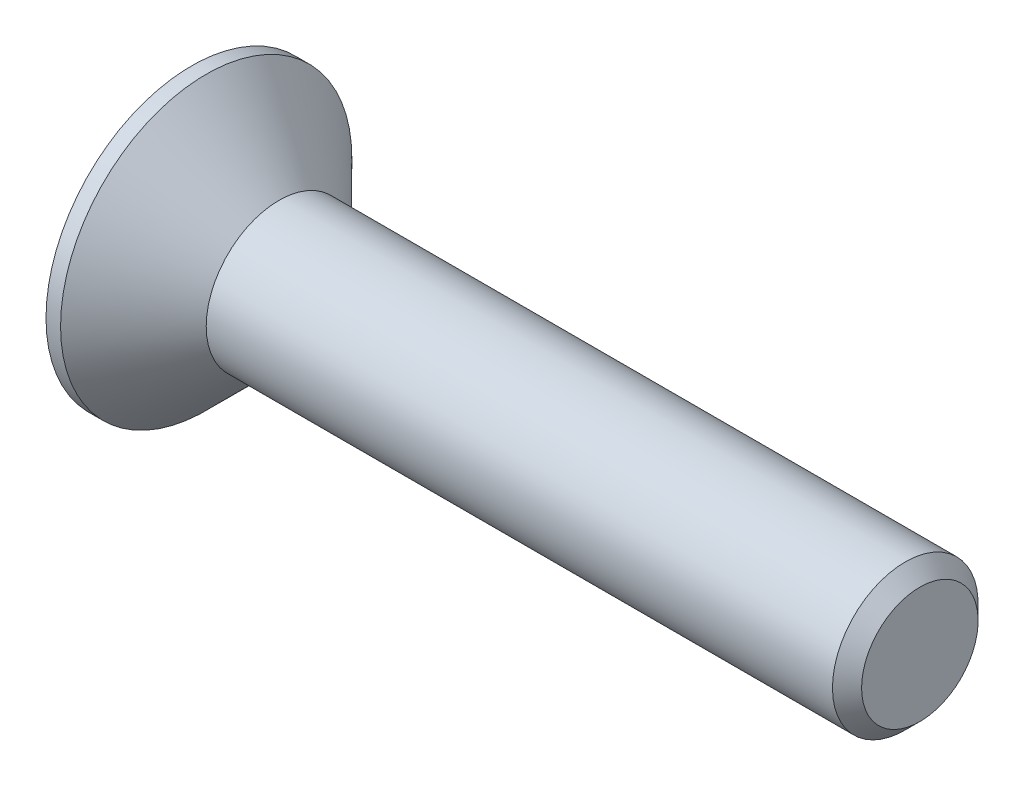
ISO-10303-21;
HEADER;
FILE_DESCRIPTION(('STEP AP214'),'2;1');
FILE_NAME('part.step','',(''),(''),'','','');
FILE_SCHEMA(('AUTOMOTIVE_DESIGN { 1 0 10303 214 1 1 1 1 }'));
ENDSEC;
DATA;
#1=APPLICATION_CONTEXT('core data for automotive mechanical design processes');
#2=APPLICATION_PROTOCOL_DEFINITION('international standard','automotive_design',2000,#1);
#3=PRODUCT_CONTEXT('',#1,'mechanical');
#4=PRODUCT('Part','Part','',(#3));
#5=PRODUCT_RELATED_PRODUCT_CATEGORY('part','',(#4));
#6=PRODUCT_DEFINITION_FORMATION('','',#4);
#7=PRODUCT_DEFINITION_CONTEXT('part definition',#1,'design');
#8=PRODUCT_DEFINITION('design','',#6,#7);
#9=PRODUCT_DEFINITION_SHAPE('','',#8);
#10=(LENGTH_UNIT() NAMED_UNIT(*) SI_UNIT(.MILLI.,.METRE.));
#11=(NAMED_UNIT(*) PLANE_ANGLE_UNIT() SI_UNIT($,.RADIAN.));
#12=(NAMED_UNIT(*) SI_UNIT($,.STERADIAN.) SOLID_ANGLE_UNIT());
#13=UNCERTAINTY_MEASURE_WITH_UNIT(LENGTH_MEASURE(1.E-05),#10,'distance_accuracy_value','');
#14=(GEOMETRIC_REPRESENTATION_CONTEXT(3) GLOBAL_UNCERTAINTY_ASSIGNED_CONTEXT((#13)) GLOBAL_UNIT_ASSIGNED_CONTEXT((#10,
#11,#12)) REPRESENTATION_CONTEXT('',''));
#15=CARTESIAN_POINT('',(0.,0.,0.));
#16=DIRECTION('',(0.,0.,1.));
#17=DIRECTION('',(1.,0.,0.));
#18=AXIS2_PLACEMENT_3D('',#15,#16,#17);
#19=CARTESIAN_POINT('',(-1.2,0.,0.));
#20=DIRECTION('',(-1.,0.,0.));
#21=DIRECTION('',(0.,0.,1.));
#22=AXIS2_PLACEMENT_3D('',#19,#20,#21);
#23=CYLINDRICAL_SURFACE('',#22,1.);
#24=CARTESIAN_POINT('',(8.6,0.,0.));
#25=DIRECTION('',(-1.,0.,0.));
#26=DIRECTION('',(0.,0.,1.));
#27=AXIS2_PLACEMENT_3D('',#24,#25,#26);
#28=CIRCLE('',#27,1.);
#29=CARTESIAN_POINT('',(8.6,0.,1.));
#30=VERTEX_POINT('',#29);
#31=EDGE_CURVE('E42',#30,#30,#28,.T.);
#32=ORIENTED_EDGE('',*,*,#31,.T.);
#33=EDGE_LOOP('',(#32));
#34=FACE_BOUND('',#33,.T.);
#35=CARTESIAN_POINT('',(0.,0.,0.));
#36=DIRECTION('',(-1.,0.,0.));
#37=DIRECTION('',(0.,0.,1.));
#38=AXIS2_PLACEMENT_3D('',#35,#36,#37);
#39=CIRCLE('',#38,1.);
#40=CARTESIAN_POINT('',(0.,0.,1.));
#41=VERTEX_POINT('',#40);
#42=EDGE_CURVE('E147',#41,#41,#39,.T.);
#43=ORIENTED_EDGE('',*,*,#42,.F.);
#44=EDGE_LOOP('',(#43));
#45=FACE_BOUND('',#44,.T.);
#46=ADVANCED_FACE('F34',(#34,#45),#23,.T.);
#47=CARTESIAN_POINT('',(0.,0.,0.));
#48=DIRECTION('',(-1.,0.,0.));
#49=DIRECTION('',(0.,0.,1.));
#50=AXIS2_PLACEMENT_3D('',#47,#48,#49);
#51=CONICAL_SURFACE('',#50,1.,0.785398163397444);
#52=CARTESIAN_POINT('',(-1.00000000000001,0.,0.));
#53=DIRECTION('',(-1.,0.,0.));
#54=DIRECTION('',(0.,0.,1.));
#55=AXIS2_PLACEMENT_3D('',#52,#53,#54);
#56=CIRCLE('',#55,2.);
#57=CARTESIAN_POINT('',(-1.00000000000001,0.,2.));
#58=VERTEX_POINT('',#57);
#59=EDGE_CURVE('E144',#58,#58,#56,.T.);
#60=ORIENTED_EDGE('',*,*,#59,.F.);
#61=EDGE_LOOP('',(#60));
#62=FACE_BOUND('',#61,.T.);
#63=ORIENTED_EDGE('',*,*,#42,.T.);
#64=EDGE_LOOP('',(#63));
#65=FACE_BOUND('',#64,.T.);
#66=ADVANCED_FACE('F169',(#62,#65),#51,.T.);
#67=CARTESIAN_POINT('',(-1.2,0.,0.));
#68=DIRECTION('',(-1.,0.,0.));
#69=DIRECTION('',(0.,0.,1.));
#70=AXIS2_PLACEMENT_3D('',#67,#68,#69);
#71=CYLINDRICAL_SURFACE('',#70,2.);
#72=CARTESIAN_POINT('',(-1.2,0.,0.));
#73=DIRECTION('',(-1.,0.,0.));
#74=DIRECTION('',(0.,0.,1.));
#75=AXIS2_PLACEMENT_3D('',#72,#73,#74);
#76=CIRCLE('',#75,2.);
#77=CARTESIAN_POINT('',(-1.2,0.,2.));
#78=VERTEX_POINT('',#77);
#79=EDGE_CURVE('E136',#78,#78,#76,.T.);
#80=ORIENTED_EDGE('',*,*,#79,.F.);
#81=EDGE_LOOP('',(#80));
#82=FACE_BOUND('',#81,.T.);
#83=ORIENTED_EDGE('',*,*,#59,.T.);
#84=EDGE_LOOP('',(#83));
#85=FACE_BOUND('',#84,.T.);
#86=ADVANCED_FACE('F173',(#82,#85),#71,.T.);
#87=CARTESIAN_POINT('',(-1.2,2.,0.));
#88=DIRECTION('',(1.,0.,0.));
#89=DIRECTION('',(0.,0.,-1.));
#90=AXIS2_PLACEMENT_3D('',#87,#88,#89);
#91=PLANE('',#90);
#92=DIRECTION('',(0.,-0.866025403784439,0.5));
#93=VECTOR('',#92,1.);
#94=CARTESIAN_POINT('',(-1.2,0.,-0.750555349946514));
#95=LINE('',#94,#93);
#96=CARTESIAN_POINT('',(-1.2,0.,-0.750555349946513));
#97=VERTEX_POINT('',#96);
#98=CARTESIAN_POINT('',(-1.2,-0.65,-0.375277674973257));
#99=VERTEX_POINT('',#98);
#100=EDGE_CURVE('E123',#97,#99,#95,.T.);
#101=ORIENTED_EDGE('',*,*,#100,.F.);
#102=DIRECTION('',(0.,-0.866025403784438,-0.5));
#103=VECTOR('',#102,1.);
#104=CARTESIAN_POINT('',(-1.2,0.65,-0.375277674973257));
#105=LINE('',#104,#103);
#106=CARTESIAN_POINT('',(-1.2,0.65,-0.375277674973257));
#107=VERTEX_POINT('',#106);
#108=EDGE_CURVE('E49',#107,#97,#105,.T.);
#109=ORIENTED_EDGE('',*,*,#108,.F.);
#110=DIRECTION('',(0.,0.,-1.));
#111=VECTOR('',#110,1.);
#112=CARTESIAN_POINT('',(-1.2,0.65,0.375277674973257));
#113=LINE('',#112,#111);
#114=CARTESIAN_POINT('',(-1.2,0.65,0.375277674973257));
#115=VERTEX_POINT('',#114);
#116=EDGE_CURVE('E132',#115,#107,#113,.T.);
#117=ORIENTED_EDGE('',*,*,#116,.F.);
#118=DIRECTION('',(0.,0.866025403784439,-0.5));
#119=VECTOR('',#118,1.);
#120=CARTESIAN_POINT('',(-1.2,0.,0.750555349946513));
#121=LINE('',#120,#119);
#122=CARTESIAN_POINT('',(-1.2,0.,0.750555349946513));
#123=VERTEX_POINT('',#122);
#124=EDGE_CURVE('E130',#123,#115,#121,.T.);
#125=ORIENTED_EDGE('',*,*,#124,.F.);
#126=DIRECTION('',(0.,0.866025403784439,0.5));
#127=VECTOR('',#126,1.);
#128=CARTESIAN_POINT('',(-1.2,-0.65,0.375277674973257));
#129=LINE('',#128,#127);
#130=CARTESIAN_POINT('',(-1.2,-0.65,0.375277674973257));
#131=VERTEX_POINT('',#130);
#132=EDGE_CURVE('E97',#131,#123,#129,.T.);
#133=ORIENTED_EDGE('',*,*,#132,.F.);
#134=DIRECTION('',(0.,0.,1.));
#135=VECTOR('',#134,1.);
#136=CARTESIAN_POINT('',(-1.2,-0.65,-0.375277674973257));
#137=LINE('',#136,#135);
#138=EDGE_CURVE('E126',#99,#131,#137,.T.);
#139=ORIENTED_EDGE('',*,*,#138,.F.);
#140=EDGE_LOOP('',(#101,#109,#117,#125,#133,#139));
#141=FACE_BOUND('',#140,.T.);
#142=ORIENTED_EDGE('',*,*,#79,.T.);
#143=EDGE_LOOP('',(#142));
#144=FACE_BOUND('',#143,.T.);
#145=ADVANCED_FACE('F164',(#141,#144),#91,.F.);
#146=CARTESIAN_POINT('',(8.8,0.,0.));
#147=DIRECTION('',(-1.,0.,0.));
#148=DIRECTION('',(0.,0.,1.));
#149=AXIS2_PLACEMENT_3D('',#146,#147,#148);
#150=PLANE('',#149);
#151=CARTESIAN_POINT('',(8.8,0.,0.));
#152=DIRECTION('',(-1.,0.,0.));
#153=DIRECTION('',(0.,0.,1.));
#154=AXIS2_PLACEMENT_3D('',#151,#152,#153);
#155=CIRCLE('',#154,0.799999999999999);
#156=CARTESIAN_POINT('',(8.8,0.,0.799999999999999));
#157=VERTEX_POINT('',#156);
#158=EDGE_CURVE('E11',#157,#157,#155,.F.);
#159=ORIENTED_EDGE('',*,*,#158,.T.);
#160=EDGE_LOOP('',(#159));
#161=FACE_BOUND('',#160,.T.);
#162=ADVANCED_FACE('F156',(#161),#150,.F.);
#163=CARTESIAN_POINT('',(8.6,0.,0.));
#164=DIRECTION('',(-1.,0.,0.));
#165=DIRECTION('',(0.,0.,1.));
#166=AXIS2_PLACEMENT_3D('',#163,#164,#165);
#167=CONICAL_SURFACE('',#166,1.,0.785398163397448);
#168=ORIENTED_EDGE('',*,*,#158,.F.);
#169=EDGE_LOOP('',(#168));
#170=FACE_BOUND('',#169,.T.);
#171=ORIENTED_EDGE('',*,*,#31,.F.);
#172=EDGE_LOOP('',(#171));
#173=FACE_BOUND('',#172,.T.);
#174=ADVANCED_FACE('F36',(#170,#173),#167,.T.);
#175=CARTESIAN_POINT('',(-0.45,0.65,-0.375277674973257));
#176=DIRECTION('',(0.,0.5,-0.866025403784439));
#177=DIRECTION('',(0.,0.866025403784439,0.5));
#178=AXIS2_PLACEMENT_3D('',#175,#176,#177);
#179=PLANE('',#178);
#180=ORIENTED_EDGE('',*,*,#108,.T.);
#181=DIRECTION('',(-1.,0.,0.));
#182=VECTOR('',#181,1.);
#183=CARTESIAN_POINT('',(-0.45,0.,-0.750555349946514));
#184=LINE('',#183,#182);
#185=CARTESIAN_POINT('',(-0.45,0.,-0.750555349946514));
#186=VERTEX_POINT('',#185);
#187=EDGE_CURVE('E79',#186,#97,#184,.T.);
#188=ORIENTED_EDGE('',*,*,#187,.F.);
#189=DIRECTION('',(0.,-0.866025403784438,-0.5));
#190=VECTOR('',#189,1.);
#191=CARTESIAN_POINT('',(-0.45,0.65,-0.375277674973257));
#192=LINE('',#191,#190);
#193=CARTESIAN_POINT('',(-0.45,0.65,-0.375277674973257));
#194=VERTEX_POINT('',#193);
#195=EDGE_CURVE('E134',#194,#186,#192,.T.);
#196=ORIENTED_EDGE('',*,*,#195,.F.);
#197=DIRECTION('',(-1.,0.,0.));
#198=VECTOR('',#197,1.);
#199=CARTESIAN_POINT('',(-0.45,0.65,-0.375277674973257));
#200=LINE('',#199,#198);
#201=EDGE_CURVE('E57',#194,#107,#200,.T.);
#202=ORIENTED_EDGE('',*,*,#201,.T.);
#203=EDGE_LOOP('',(#180,#188,#196,#202));
#204=FACE_BOUND('',#203,.T.);
#205=ADVANCED_FACE('F155',(#204),#179,.F.);
#206=CARTESIAN_POINT('',(-0.45,0.65,0.375277674973257));
#207=DIRECTION('',(0.,1.,0.));
#208=DIRECTION('',(0.,0.,1.));
#209=AXIS2_PLACEMENT_3D('',#206,#207,#208);
#210=PLANE('',#209);
#211=ORIENTED_EDGE('',*,*,#116,.T.);
#212=ORIENTED_EDGE('',*,*,#201,.F.);
#213=DIRECTION('',(0.,0.,-1.));
#214=VECTOR('',#213,1.);
#215=CARTESIAN_POINT('',(-0.45,0.65,0.375277674973257));
#216=LINE('',#215,#214);
#217=CARTESIAN_POINT('',(-0.45,0.65,0.375277674973257));
#218=VERTEX_POINT('',#217);
#219=EDGE_CURVE('E109',#218,#194,#216,.T.);
#220=ORIENTED_EDGE('',*,*,#219,.F.);
#221=DIRECTION('',(-1.,0.,0.));
#222=VECTOR('',#221,1.);
#223=CARTESIAN_POINT('',(-0.45,0.65,0.375277674973257));
#224=LINE('',#223,#222);
#225=EDGE_CURVE('E101',#218,#115,#224,.T.);
#226=ORIENTED_EDGE('',*,*,#225,.T.);
#227=EDGE_LOOP('',(#211,#212,#220,#226));
#228=FACE_BOUND('',#227,.T.);
#229=ADVANCED_FACE('F162',(#228),#210,.F.);
#230=CARTESIAN_POINT('',(-0.45,0.,0.750555349946513));
#231=DIRECTION('',(0.,0.5,0.866025403784439));
#232=DIRECTION('',(0.,-0.866025403784439,0.5));
#233=AXIS2_PLACEMENT_3D('',#230,#231,#232);
#234=PLANE('',#233);
#235=ORIENTED_EDGE('',*,*,#124,.T.);
#236=ORIENTED_EDGE('',*,*,#225,.F.);
#237=DIRECTION('',(0.,0.866025403784439,-0.5));
#238=VECTOR('',#237,1.);
#239=CARTESIAN_POINT('',(-0.45,0.,0.750555349946513));
#240=LINE('',#239,#238);
#241=CARTESIAN_POINT('',(-0.45,0.,0.750555349946513));
#242=VERTEX_POINT('',#241);
#243=EDGE_CURVE('E105',#242,#218,#240,.T.);
#244=ORIENTED_EDGE('',*,*,#243,.F.);
#245=DIRECTION('',(-1.,0.,0.));
#246=VECTOR('',#245,1.);
#247=CARTESIAN_POINT('',(-0.45,0.,0.750555349946513));
#248=LINE('',#247,#246);
#249=EDGE_CURVE('E90',#242,#123,#248,.T.);
#250=ORIENTED_EDGE('',*,*,#249,.T.);
#251=EDGE_LOOP('',(#235,#236,#244,#250));
#252=FACE_BOUND('',#251,.T.);
#253=ADVANCED_FACE('F106',(#252),#234,.F.);
#254=CARTESIAN_POINT('',(-0.45,-0.65,0.375277674973257));
#255=DIRECTION('',(0.,-0.5,0.866025403784439));
#256=DIRECTION('',(0.,-0.866025403784439,-0.5));
#257=AXIS2_PLACEMENT_3D('',#254,#255,#256);
#258=PLANE('',#257);
#259=ORIENTED_EDGE('',*,*,#132,.T.);
#260=ORIENTED_EDGE('',*,*,#249,.F.);
#261=DIRECTION('',(0.,0.866025403784439,0.5));
#262=VECTOR('',#261,1.);
#263=CARTESIAN_POINT('',(-0.45,-0.65,0.375277674973257));
#264=LINE('',#263,#262);
#265=CARTESIAN_POINT('',(-0.45,-0.65,0.375277674973257));
#266=VERTEX_POINT('',#265);
#267=EDGE_CURVE('E94',#266,#242,#264,.T.);
#268=ORIENTED_EDGE('',*,*,#267,.F.);
#269=DIRECTION('',(-1.,0.,0.));
#270=VECTOR('',#269,1.);
#271=CARTESIAN_POINT('',(-0.45,-0.65,0.375277674973257));
#272=LINE('',#271,#270);
#273=EDGE_CURVE('E102',#266,#131,#272,.T.);
#274=ORIENTED_EDGE('',*,*,#273,.T.);
#275=EDGE_LOOP('',(#259,#260,#268,#274));
#276=FACE_BOUND('',#275,.T.);
#277=ADVANCED_FACE('F92',(#276),#258,.F.);
#278=CARTESIAN_POINT('',(-0.45,-0.65,-0.375277674973257));
#279=DIRECTION('',(0.,-1.,0.));
#280=DIRECTION('',(0.,0.,-1.));
#281=AXIS2_PLACEMENT_3D('',#278,#279,#280);
#282=PLANE('',#281);
#283=ORIENTED_EDGE('',*,*,#138,.T.);
#284=ORIENTED_EDGE('',*,*,#273,.F.);
#285=DIRECTION('',(0.,0.,1.));
#286=VECTOR('',#285,1.);
#287=CARTESIAN_POINT('',(-0.45,-0.65,-0.375277674973257));
#288=LINE('',#287,#286);
#289=CARTESIAN_POINT('',(-0.45,-0.65,-0.375277674973257));
#290=VERTEX_POINT('',#289);
#291=EDGE_CURVE('E115',#290,#266,#288,.T.);
#292=ORIENTED_EDGE('',*,*,#291,.F.);
#293=DIRECTION('',(-1.,0.,0.));
#294=VECTOR('',#293,1.);
#295=CARTESIAN_POINT('',(-0.45,-0.65,-0.375277674973257));
#296=LINE('',#295,#294);
#297=EDGE_CURVE('E139',#290,#99,#296,.T.);
#298=ORIENTED_EDGE('',*,*,#297,.T.);
#299=EDGE_LOOP('',(#283,#284,#292,#298));
#300=FACE_BOUND('',#299,.T.);
#301=ADVANCED_FACE('F186',(#300),#282,.F.);
#302=CARTESIAN_POINT('',(-0.45,0.,-0.750555349946514));
#303=DIRECTION('',(0.,-0.5,-0.866025403784439));
#304=DIRECTION('',(0.,0.866025403784439,-0.5));
#305=AXIS2_PLACEMENT_3D('',#302,#303,#304);
#306=PLANE('',#305);
#307=ORIENTED_EDGE('',*,*,#100,.T.);
#308=ORIENTED_EDGE('',*,*,#297,.F.);
#309=DIRECTION('',(0.,-0.866025403784439,0.5));
#310=VECTOR('',#309,1.);
#311=CARTESIAN_POINT('',(-0.45,0.,-0.750555349946514));
#312=LINE('',#311,#310);
#313=EDGE_CURVE('E117',#186,#290,#312,.T.);
#314=ORIENTED_EDGE('',*,*,#313,.F.);
#315=ORIENTED_EDGE('',*,*,#187,.T.);
#316=EDGE_LOOP('',(#307,#308,#314,#315));
#317=FACE_BOUND('',#316,.T.);
#318=ADVANCED_FACE('F183',(#317),#306,.F.);
#319=CARTESIAN_POINT('',(-0.45,0.,0.));
#320=DIRECTION('',(-1.,0.,0.));
#321=DIRECTION('',(0.,0.,1.));
#322=AXIS2_PLACEMENT_3D('',#319,#320,#321);
#323=PLANE('',#322);
#324=ORIENTED_EDGE('',*,*,#195,.T.);
#325=ORIENTED_EDGE('',*,*,#313,.T.);
#326=ORIENTED_EDGE('',*,*,#291,.T.);
#327=ORIENTED_EDGE('',*,*,#267,.T.);
#328=ORIENTED_EDGE('',*,*,#243,.T.);
#329=ORIENTED_EDGE('',*,*,#219,.T.);
#330=EDGE_LOOP('',(#324,#325,#326,#327,#328,#329));
#331=FACE_BOUND('',#330,.T.);
#332=ADVANCED_FACE('F112',(#331),#323,.T.);
#333=CLOSED_SHELL('',(#46,#66,#86,#145,#162,#174,#205,#229,#253,#277,#301,#318,#332));
#334=MANIFOLD_SOLID_BREP('B2',#333);
#335=ADVANCED_BREP_SHAPE_REPRESENTATION('',(#18,#334),#14);
#336=SHAPE_DEFINITION_REPRESENTATION(#9,#335);
ENDSEC;
END-ISO-10303-21;
